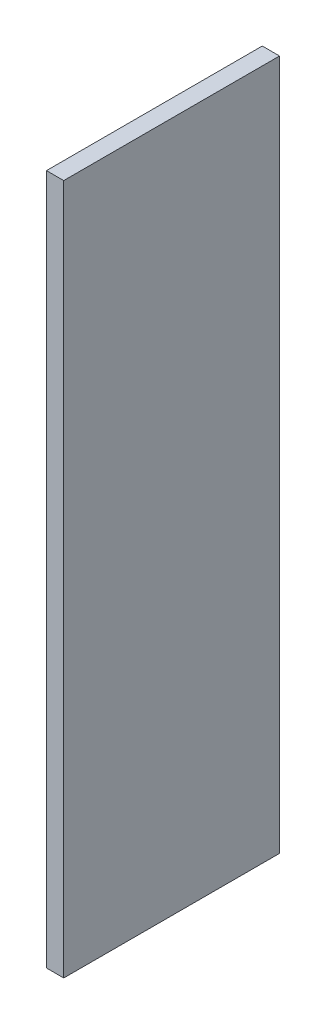
ISO-10303-21;
HEADER;
FILE_DESCRIPTION(('STEP AP214'),'2;1');
FILE_NAME('part.step','',(''),(''),'','','');
FILE_SCHEMA(('AUTOMOTIVE_DESIGN { 1 0 10303 214 1 1 1 1 }'));
ENDSEC;
DATA;
#1=APPLICATION_CONTEXT('core data for automotive mechanical design processes');
#2=APPLICATION_PROTOCOL_DEFINITION('international standard','automotive_design',2000,#1);
#3=PRODUCT_CONTEXT('',#1,'mechanical');
#4=PRODUCT('Part','Part','',(#3));
#5=PRODUCT_RELATED_PRODUCT_CATEGORY('part','',(#4));
#6=PRODUCT_DEFINITION_FORMATION('','',#4);
#7=PRODUCT_DEFINITION_CONTEXT('part definition',#1,'design');
#8=PRODUCT_DEFINITION('design','',#6,#7);
#9=PRODUCT_DEFINITION_SHAPE('','',#8);
#10=(LENGTH_UNIT() NAMED_UNIT(*) SI_UNIT(.MILLI.,.METRE.));
#11=(NAMED_UNIT(*) PLANE_ANGLE_UNIT() SI_UNIT($,.RADIAN.));
#12=(NAMED_UNIT(*) SI_UNIT($,.STERADIAN.) SOLID_ANGLE_UNIT());
#13=UNCERTAINTY_MEASURE_WITH_UNIT(LENGTH_MEASURE(1.E-05),#10,'distance_accuracy_value','');
#14=(GEOMETRIC_REPRESENTATION_CONTEXT(3) GLOBAL_UNCERTAINTY_ASSIGNED_CONTEXT((#13)) GLOBAL_UNIT_ASSIGNED_CONTEXT((#10,
#11,#12)) REPRESENTATION_CONTEXT('',''));
#15=CARTESIAN_POINT('',(0.,0.,0.));
#16=DIRECTION('',(0.,0.,1.));
#17=DIRECTION('',(1.,0.,0.));
#18=AXIS2_PLACEMENT_3D('',#15,#16,#17);
#19=CARTESIAN_POINT('',(0.,101.6,0.));
#20=DIRECTION('',(1.,0.,0.));
#21=DIRECTION('',(0.,0.,-1.));
#22=AXIS2_PLACEMENT_3D('',#19,#20,#21);
#23=PLANE('',#22);
#24=CARTESIAN_POINT('',(0.,83.3838191668903,-15.8749999999999));
#25=DIRECTION('',(1.,0.,0.));
#26=DIRECTION('',(0.,0.,1.));
#27=AXIS2_PLACEMENT_3D('',#24,#25,#26);
#28=CIRCLE('',#27,4.7625);
#29=CARTESIAN_POINT('',(0.,83.3838191668903,-11.1124999999999));
#30=VERTEX_POINT('',#29);
#31=EDGE_CURVE('E255',#30,#30,#28,.T.);
#32=ORIENTED_EDGE('',*,*,#31,.T.);
#33=EDGE_LOOP('',(#32));
#34=FACE_BOUND('',#33,.T.);
#35=CARTESIAN_POINT('',(0.,19.05,-15.8749999999999));
#36=DIRECTION('',(1.,0.,0.));
#37=DIRECTION('',(0.,0.,-1.));
#38=AXIS2_PLACEMENT_3D('',#35,#36,#37);
#39=CIRCLE('',#38,4.7625);
#40=CARTESIAN_POINT('',(0.,19.05,-20.6374999999999));
#41=VERTEX_POINT('',#40);
#42=EDGE_CURVE('E246',#41,#41,#39,.T.);
#43=ORIENTED_EDGE('',*,*,#42,.T.);
#44=EDGE_LOOP('',(#43));
#45=FACE_BOUND('',#44,.T.);
#46=DIRECTION('',(0.,0.,1.));
#47=VECTOR('',#46,1.);
#48=CARTESIAN_POINT('',(0.,0.,0.));
#49=LINE('',#48,#47);
#50=CARTESIAN_POINT('',(0.,0.,-31.75));
#51=VERTEX_POINT('',#50);
#52=CARTESIAN_POINT('',(0.,0.,0.));
#53=VERTEX_POINT('',#52);
#54=EDGE_CURVE('E100',#51,#53,#49,.T.);
#55=ORIENTED_EDGE('',*,*,#54,.T.);
#56=DIRECTION('',(0.,-1.,0.));
#57=VECTOR('',#56,1.);
#58=CARTESIAN_POINT('',(0.,101.6,0.));
#59=LINE('',#58,#57);
#60=CARTESIAN_POINT('',(0.,101.6,0.));
#61=VERTEX_POINT('',#60);
#62=EDGE_CURVE('E91',#61,#53,#59,.T.);
#63=ORIENTED_EDGE('',*,*,#62,.F.);
#64=DIRECTION('',(0.,0.,1.));
#65=VECTOR('',#64,1.);
#66=CARTESIAN_POINT('',(0.,101.6,0.));
#67=LINE('',#66,#65);
#68=CARTESIAN_POINT('',(0.,101.6,-31.75));
#69=VERTEX_POINT('',#68);
#70=EDGE_CURVE('E85',#69,#61,#67,.T.);
#71=ORIENTED_EDGE('',*,*,#70,.F.);
#72=DIRECTION('',(0.,-1.,0.));
#73=VECTOR('',#72,1.);
#74=CARTESIAN_POINT('',(0.,101.6,-31.75));
#75=LINE('',#74,#73);
#76=EDGE_CURVE('E96',#69,#51,#75,.T.);
#77=ORIENTED_EDGE('',*,*,#76,.T.);
#78=EDGE_LOOP('',(#55,#63,#71,#77));
#79=FACE_BOUND('',#78,.T.);
#80=ADVANCED_FACE('F33',(#34,#45,#79),#23,.F.);
#81=CARTESIAN_POINT('',(0.,101.6,0.));
#82=DIRECTION('',(0.,0.,-1.));
#83=DIRECTION('',(-1.,0.,0.));
#84=AXIS2_PLACEMENT_3D('',#81,#82,#83);
#85=PLANE('',#84);
#86=DIRECTION('',(1.,0.,0.));
#87=VECTOR('',#86,1.);
#88=CARTESIAN_POINT('',(0.,0.,0.));
#89=LINE('',#88,#87);
#90=CARTESIAN_POINT('',(2.54,0.,0.));
#91=VERTEX_POINT('',#90);
#92=EDGE_CURVE('E90',#53,#91,#89,.T.);
#93=ORIENTED_EDGE('',*,*,#92,.T.);
#94=DIRECTION('',(0.,-1.,0.));
#95=VECTOR('',#94,1.);
#96=CARTESIAN_POINT('',(2.54,101.6,0.));
#97=LINE('',#96,#95);
#98=CARTESIAN_POINT('',(2.54,101.6,0.));
#99=VERTEX_POINT('',#98);
#100=EDGE_CURVE('E88',#99,#91,#97,.T.);
#101=ORIENTED_EDGE('',*,*,#100,.F.);
#102=DIRECTION('',(1.,0.,0.));
#103=VECTOR('',#102,1.);
#104=CARTESIAN_POINT('',(0.,101.6,0.));
#105=LINE('',#104,#103);
#106=EDGE_CURVE('E80',#61,#99,#105,.T.);
#107=ORIENTED_EDGE('',*,*,#106,.F.);
#108=ORIENTED_EDGE('',*,*,#62,.T.);
#109=EDGE_LOOP('',(#93,#101,#107,#108));
#110=FACE_BOUND('',#109,.T.);
#111=ADVANCED_FACE('F89',(#110),#85,.F.);
#112=CARTESIAN_POINT('',(2.54,101.6,0.));
#113=DIRECTION('',(-1.,0.,0.));
#114=DIRECTION('',(0.,0.,1.));
#115=AXIS2_PLACEMENT_3D('',#112,#113,#114);
#116=PLANE('',#115);
#117=DIRECTION('',(0.,0.,-1.));
#118=VECTOR('',#117,1.);
#119=CARTESIAN_POINT('',(2.54,0.,0.));
#120=LINE('',#119,#118);
#121=CARTESIAN_POINT('',(2.54,0.,-31.75));
#122=VERTEX_POINT('',#121);
#123=EDGE_CURVE('E66',#91,#122,#120,.T.);
#124=ORIENTED_EDGE('',*,*,#123,.T.);
#125=DIRECTION('',(0.,-1.,0.));
#126=VECTOR('',#125,1.);
#127=CARTESIAN_POINT('',(2.54,101.6,-31.75));
#128=LINE('',#127,#126);
#129=CARTESIAN_POINT('',(2.54,101.6,-31.75));
#130=VERTEX_POINT('',#129);
#131=EDGE_CURVE('E92',#130,#122,#128,.T.);
#132=ORIENTED_EDGE('',*,*,#131,.F.);
#133=DIRECTION('',(0.,0.,-1.));
#134=VECTOR('',#133,1.);
#135=CARTESIAN_POINT('',(2.54,101.6,0.));
#136=LINE('',#135,#134);
#137=EDGE_CURVE('E83',#99,#130,#136,.T.);
#138=ORIENTED_EDGE('',*,*,#137,.F.);
#139=ORIENTED_EDGE('',*,*,#100,.T.);
#140=EDGE_LOOP('',(#124,#132,#138,#139));
#141=FACE_BOUND('',#140,.T.);
#142=ADVANCED_FACE('F94',(#141),#116,.F.);
#143=CARTESIAN_POINT('',(0.,101.6,-31.75));
#144=DIRECTION('',(0.,0.,1.));
#145=DIRECTION('',(1.,0.,0.));
#146=AXIS2_PLACEMENT_3D('',#143,#144,#145);
#147=PLANE('',#146);
#148=DIRECTION('',(-1.,0.,0.));
#149=VECTOR('',#148,1.);
#150=CARTESIAN_POINT('',(0.,0.,-31.75));
#151=LINE('',#150,#149);
#152=EDGE_CURVE('E72',#122,#51,#151,.T.);
#153=ORIENTED_EDGE('',*,*,#152,.T.);
#154=ORIENTED_EDGE('',*,*,#76,.F.);
#155=DIRECTION('',(-1.,0.,0.));
#156=VECTOR('',#155,1.);
#157=CARTESIAN_POINT('',(0.,101.6,-31.75));
#158=LINE('',#157,#156);
#159=EDGE_CURVE('E49',#130,#69,#158,.T.);
#160=ORIENTED_EDGE('',*,*,#159,.F.);
#161=ORIENTED_EDGE('',*,*,#131,.T.);
#162=EDGE_LOOP('',(#153,#154,#160,#161));
#163=FACE_BOUND('',#162,.T.);
#164=ADVANCED_FACE('F157',(#163),#147,.F.);
#165=CARTESIAN_POINT('',(0.,101.6,0.));
#166=DIRECTION('',(0.,-1.,0.));
#167=DIRECTION('',(0.,0.,-1.));
#168=AXIS2_PLACEMENT_3D('',#165,#166,#167);
#169=PLANE('',#168);
#170=ORIENTED_EDGE('',*,*,#70,.T.);
#171=ORIENTED_EDGE('',*,*,#106,.T.);
#172=ORIENTED_EDGE('',*,*,#137,.T.);
#173=ORIENTED_EDGE('',*,*,#159,.T.);
#174=EDGE_LOOP('',(#170,#171,#172,#173));
#175=FACE_BOUND('',#174,.T.);
#176=ADVANCED_FACE('F81',(#175),#169,.F.);
#177=CARTESIAN_POINT('',(0.,0.,0.));
#178=DIRECTION('',(0.,-1.,0.));
#179=DIRECTION('',(0.,0.,-1.));
#180=AXIS2_PLACEMENT_3D('',#177,#178,#179);
#181=PLANE('',#180);
#182=ORIENTED_EDGE('',*,*,#54,.F.);
#183=ORIENTED_EDGE('',*,*,#152,.F.);
#184=ORIENTED_EDGE('',*,*,#123,.F.);
#185=ORIENTED_EDGE('',*,*,#92,.F.);
#186=EDGE_LOOP('',(#182,#183,#184,#185));
#187=FACE_BOUND('',#186,.T.);
#188=ADVANCED_FACE('F153',(#187),#181,.T.);
#189=CARTESIAN_POINT('',(-6.35,19.05,-15.8749999999999));
#190=DIRECTION('',(1.,0.,0.));
#191=DIRECTION('',(0.,0.,-1.));
#192=AXIS2_PLACEMENT_3D('',#189,#190,#191);
#193=CYLINDRICAL_SURFACE('',#192,4.7625);
#194=CARTESIAN_POINT('',(-6.35,19.05,-15.8749999999999));
#195=DIRECTION('',(1.,0.,0.));
#196=DIRECTION('',(0.,0.,-1.));
#197=AXIS2_PLACEMENT_3D('',#194,#195,#196);
#198=CIRCLE('',#197,4.7625);
#199=CARTESIAN_POINT('',(-6.35,19.05,-20.6374999999999));
#200=VERTEX_POINT('',#199);
#201=EDGE_CURVE('E103',#200,#200,#198,.T.);
#202=ORIENTED_EDGE('',*,*,#201,.T.);
#203=EDGE_LOOP('',(#202));
#204=FACE_BOUND('',#203,.T.);
#205=ORIENTED_EDGE('',*,*,#42,.F.);
#206=EDGE_LOOP('',(#205));
#207=FACE_BOUND('',#206,.T.);
#208=ADVANCED_FACE('F149',(#204,#207),#193,.T.);
#209=CARTESIAN_POINT('',(-6.35,19.05,-15.8749999999999));
#210=DIRECTION('',(1.,0.,0.));
#211=DIRECTION('',(0.,0.,-1.));
#212=AXIS2_PLACEMENT_3D('',#209,#210,#211);
#213=PLANE('',#212);
#214=CARTESIAN_POINT('',(-6.35,19.05,-15.8749999999999));
#215=DIRECTION('',(1.,0.,0.));
#216=DIRECTION('',(0.,0.,-1.));
#217=AXIS2_PLACEMENT_3D('',#214,#215,#216);
#218=CIRCLE('',#217,3.175);
#219=CARTESIAN_POINT('',(-6.35,19.05,-19.0499999999999));
#220=VERTEX_POINT('',#219);
#221=EDGE_CURVE('E249',#220,#220,#218,.T.);
#222=ORIENTED_EDGE('',*,*,#221,.T.);
#223=EDGE_LOOP('',(#222));
#224=FACE_BOUND('',#223,.T.);
#225=ORIENTED_EDGE('',*,*,#201,.F.);
#226=EDGE_LOOP('',(#225));
#227=FACE_BOUND('',#226,.T.);
#228=ADVANCED_FACE('F125',(#224,#227),#213,.F.);
#229=CARTESIAN_POINT('',(-6.35,19.05,-15.8749999999999));
#230=DIRECTION('',(1.,0.,0.));
#231=DIRECTION('',(0.,0.,-1.));
#232=AXIS2_PLACEMENT_3D('',#229,#230,#231);
#233=CYLINDRICAL_SURFACE('',#232,3.175);
#234=ORIENTED_EDGE('',*,*,#221,.F.);
#235=EDGE_LOOP('',(#234));
#236=FACE_BOUND('',#235,.T.);
#237=CARTESIAN_POINT('',(0.,19.05,-15.8749999999999));
#238=DIRECTION('',(1.,0.,0.));
#239=DIRECTION('',(0.,0.,-1.));
#240=AXIS2_PLACEMENT_3D('',#237,#238,#239);
#241=CIRCLE('',#240,3.175);
#242=CARTESIAN_POINT('',(0.,19.05,-19.0499999999999));
#243=VERTEX_POINT('',#242);
#244=EDGE_CURVE('E41',#243,#243,#241,.T.);
#245=ORIENTED_EDGE('',*,*,#244,.T.);
#246=EDGE_LOOP('',(#245));
#247=FACE_BOUND('',#246,.T.);
#248=ADVANCED_FACE('F112',(#236,#247),#233,.F.);
#249=ORIENTED_EDGE('',*,*,#244,.F.);
#250=EDGE_LOOP('',(#249));
#251=FACE_BOUND('',#250,.T.);
#252=ADVANCED_FACE('F114',(#251),#23,.F.);
#253=CARTESIAN_POINT('',(-6.35,83.3838191668903,-15.8749999999999));
#254=DIRECTION('',(1.,0.,0.));
#255=DIRECTION('',(0.,0.,-1.));
#256=AXIS2_PLACEMENT_3D('',#253,#254,#255);
#257=CYLINDRICAL_SURFACE('',#256,4.7625);
#258=CARTESIAN_POINT('',(-6.35,83.3838191668903,-15.8749999999999));
#259=DIRECTION('',(1.,0.,0.));
#260=DIRECTION('',(0.,0.,1.));
#261=AXIS2_PLACEMENT_3D('',#258,#259,#260);
#262=CIRCLE('',#261,4.7625);
#263=CARTESIAN_POINT('',(-6.35,83.3838191668903,-11.1124999999999));
#264=VERTEX_POINT('',#263);
#265=EDGE_CURVE('E254',#264,#264,#262,.T.);
#266=ORIENTED_EDGE('',*,*,#265,.T.);
#267=EDGE_LOOP('',(#266));
#268=FACE_BOUND('',#267,.T.);
#269=ORIENTED_EDGE('',*,*,#31,.F.);
#270=EDGE_LOOP('',(#269));
#271=FACE_BOUND('',#270,.T.);
#272=ADVANCED_FACE('F116',(#268,#271),#257,.T.);
#273=CARTESIAN_POINT('',(-6.35,83.3838191668903,-15.8749999999999));
#274=DIRECTION('',(-1.,0.,0.));
#275=DIRECTION('',(0.,0.,1.));
#276=AXIS2_PLACEMENT_3D('',#273,#274,#275);
#277=PLANE('',#276);
#278=CARTESIAN_POINT('',(-6.35,83.3838191668903,-15.8749999999999));
#279=DIRECTION('',(1.,0.,0.));
#280=DIRECTION('',(0.,0.,1.));
#281=AXIS2_PLACEMENT_3D('',#278,#279,#280);
#282=CIRCLE('',#281,3.175);
#283=CARTESIAN_POINT('',(-6.35,83.3838191668903,-12.6999999999999));
#284=VERTEX_POINT('',#283);
#285=EDGE_CURVE('E258',#284,#284,#282,.T.);
#286=ORIENTED_EDGE('',*,*,#285,.T.);
#287=EDGE_LOOP('',(#286));
#288=FACE_BOUND('',#287,.T.);
#289=ORIENTED_EDGE('',*,*,#265,.F.);
#290=EDGE_LOOP('',(#289));
#291=FACE_BOUND('',#290,.T.);
#292=ADVANCED_FACE('F122',(#288,#291),#277,.T.);
#293=CARTESIAN_POINT('',(-6.35,83.3838191668903,-15.8749999999999));
#294=DIRECTION('',(1.,0.,0.));
#295=DIRECTION('',(0.,0.,-1.));
#296=AXIS2_PLACEMENT_3D('',#293,#294,#295);
#297=CYLINDRICAL_SURFACE('',#296,3.175);
#298=ORIENTED_EDGE('',*,*,#285,.F.);
#299=EDGE_LOOP('',(#298));
#300=FACE_BOUND('',#299,.T.);
#301=CARTESIAN_POINT('',(0.,83.3838191668903,-15.8749999999999));
#302=DIRECTION('',(1.,0.,0.));
#303=DIRECTION('',(0.,0.,-1.));
#304=AXIS2_PLACEMENT_3D('',#301,#302,#303);
#305=CIRCLE('',#304,3.175);
#306=CARTESIAN_POINT('',(0.,83.3838191668903,-19.0499999999999));
#307=VERTEX_POINT('',#306);
#308=EDGE_CURVE('E11',#307,#307,#305,.T.);
#309=ORIENTED_EDGE('',*,*,#308,.T.);
#310=EDGE_LOOP('',(#309));
#311=FACE_BOUND('',#310,.T.);
#312=ADVANCED_FACE('F131',(#300,#311),#297,.F.);
#313=ORIENTED_EDGE('',*,*,#308,.F.);
#314=EDGE_LOOP('',(#313));
#315=FACE_BOUND('',#314,.T.);
#316=ADVANCED_FACE('F117',(#315),#23,.F.);
#317=CLOSED_SHELL('',(#80,#111,#142,#164,#176,#188,#208,#228,#248,#252,#272,#292,#312,#316));
#318=MANIFOLD_SOLID_BREP('B2',#317);
#319=ADVANCED_BREP_SHAPE_REPRESENTATION('',(#18,#318),#14);
#320=SHAPE_DEFINITION_REPRESENTATION(#9,#319);
ENDSEC;
END-ISO-10303-21;
